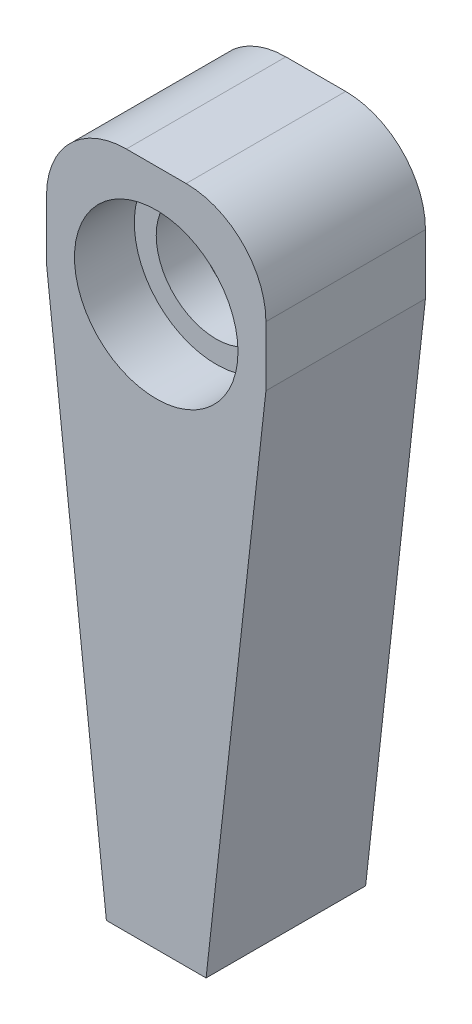
ISO-10303-21;
HEADER;
FILE_DESCRIPTION(('STEP AP214'),'2;1');
FILE_NAME('part.step','',(''),(''),'','','');
FILE_SCHEMA(('AUTOMOTIVE_DESIGN { 1 0 10303 214 1 1 1 1 }'));
ENDSEC;
DATA;
#1=APPLICATION_CONTEXT('core data for automotive mechanical design processes');
#2=APPLICATION_PROTOCOL_DEFINITION('international standard','automotive_design',2000,#1);
#3=PRODUCT_CONTEXT('',#1,'mechanical');
#4=PRODUCT('Part','Part','',(#3));
#5=PRODUCT_RELATED_PRODUCT_CATEGORY('part','',(#4));
#6=PRODUCT_DEFINITION_FORMATION('','',#4);
#7=PRODUCT_DEFINITION_CONTEXT('part definition',#1,'design');
#8=PRODUCT_DEFINITION('design','',#6,#7);
#9=PRODUCT_DEFINITION_SHAPE('','',#8);
#10=(LENGTH_UNIT() NAMED_UNIT(*) SI_UNIT(.MILLI.,.METRE.));
#11=(NAMED_UNIT(*) PLANE_ANGLE_UNIT() SI_UNIT($,.RADIAN.));
#12=(NAMED_UNIT(*) SI_UNIT($,.STERADIAN.) SOLID_ANGLE_UNIT());
#13=UNCERTAINTY_MEASURE_WITH_UNIT(LENGTH_MEASURE(1.E-05),#10,'distance_accuracy_value','');
#14=(GEOMETRIC_REPRESENTATION_CONTEXT(3) GLOBAL_UNCERTAINTY_ASSIGNED_CONTEXT((#13)) GLOBAL_UNIT_ASSIGNED_CONTEXT((#10,
#11,#12)) REPRESENTATION_CONTEXT('',''));
#15=CARTESIAN_POINT('',(0.,0.,0.));
#16=DIRECTION('',(0.,0.,1.));
#17=DIRECTION('',(1.,0.,0.));
#18=AXIS2_PLACEMENT_3D('',#15,#16,#17);
#19=CARTESIAN_POINT('',(0.,28.,4.));
#20=DIRECTION('',(0.,0.,-1.));
#21=DIRECTION('',(-1.,0.,0.));
#22=AXIS2_PLACEMENT_3D('',#19,#20,#21);
#23=CYLINDRICAL_SURFACE('',#22,3.);
#24=CARTESIAN_POINT('',(0.,28.,-0.999999999999999));
#25=DIRECTION('',(0.,0.,-1.));
#26=DIRECTION('',(-1.,0.,0.));
#27=AXIS2_PLACEMENT_3D('',#24,#25,#26);
#28=CIRCLE('',#27,3.);
#29=CARTESIAN_POINT('',(-3.,28.,-0.999999999999999));
#30=VERTEX_POINT('',#29);
#31=EDGE_CURVE('E179',#30,#30,#28,.T.);
#32=ORIENTED_EDGE('',*,*,#31,.T.);
#33=EDGE_LOOP('',(#32));
#34=FACE_BOUND('',#33,.T.);
#35=CARTESIAN_POINT('',(0.,28.,1.));
#36=DIRECTION('',(0.,0.,1.));
#37=DIRECTION('',(1.,0.,0.));
#38=AXIS2_PLACEMENT_3D('',#35,#36,#37);
#39=CIRCLE('',#38,3.);
#40=CARTESIAN_POINT('',(3.,28.,1.));
#41=VERTEX_POINT('',#40);
#42=EDGE_CURVE('E40',#41,#41,#39,.F.);
#43=ORIENTED_EDGE('',*,*,#42,.F.);
#44=EDGE_LOOP('',(#43));
#45=FACE_BOUND('',#44,.T.);
#46=ADVANCED_FACE('F36',(#34,#45),#23,.F.);
#47=CARTESIAN_POINT('',(-5.5,34.,4.));
#48=DIRECTION('',(1.,0.,0.));
#49=DIRECTION('',(0.,0.,-1.));
#50=AXIS2_PLACEMENT_3D('',#47,#48,#49);
#51=PLANE('',#50);
#52=DIRECTION('',(0.,-1.,0.));
#53=VECTOR('',#52,1.);
#54=CARTESIAN_POINT('',(-5.5,34.,4.));
#55=LINE('',#54,#53);
#56=CARTESIAN_POINT('',(-5.5,30.,4.));
#57=VERTEX_POINT('',#56);
#58=CARTESIAN_POINT('',(-5.5,27.,4.));
#59=VERTEX_POINT('',#58);
#60=EDGE_CURVE('E115',#57,#59,#55,.T.);
#61=ORIENTED_EDGE('',*,*,#60,.F.);
#62=DIRECTION('',(0.,0.,1.));
#63=VECTOR('',#62,1.);
#64=CARTESIAN_POINT('',(-5.5,30.,-4.));
#65=LINE('',#64,#63);
#66=CARTESIAN_POINT('',(-5.5,30.,-4.));
#67=VERTEX_POINT('',#66);
#68=EDGE_CURVE('E12',#57,#67,#65,.F.);
#69=ORIENTED_EDGE('',*,*,#68,.T.);
#70=DIRECTION('',(0.,-1.,0.));
#71=VECTOR('',#70,1.);
#72=CARTESIAN_POINT('',(-5.5,34.,-4.));
#73=LINE('',#72,#71);
#74=CARTESIAN_POINT('',(-5.5,27.,-4.));
#75=VERTEX_POINT('',#74);
#76=EDGE_CURVE('E139',#67,#75,#73,.T.);
#77=ORIENTED_EDGE('',*,*,#76,.T.);
#78=DIRECTION('',(0.,0.,-1.));
#79=VECTOR('',#78,1.);
#80=CARTESIAN_POINT('',(-5.5,27.,6.));
#81=LINE('',#80,#79);
#82=EDGE_CURVE('E169',#59,#75,#81,.T.);
#83=ORIENTED_EDGE('',*,*,#82,.F.);
#84=EDGE_LOOP('',(#61,#69,#77,#83));
#85=FACE_BOUND('',#84,.T.);
#86=ADVANCED_FACE('F191',(#85),#51,.F.);
#87=CARTESIAN_POINT('',(5.5,34.,4.));
#88=DIRECTION('',(0.,0.,-1.));
#89=DIRECTION('',(-1.,0.,0.));
#90=AXIS2_PLACEMENT_3D('',#87,#88,#89);
#91=PLANE('',#90);
#92=CARTESIAN_POINT('',(0.,28.,4.));
#93=DIRECTION('',(0.,0.,1.));
#94=DIRECTION('',(1.,0.,0.));
#95=AXIS2_PLACEMENT_3D('',#92,#93,#94);
#96=CIRCLE('',#95,4.1);
#97=CARTESIAN_POINT('',(4.1,28.,4.));
#98=VERTEX_POINT('',#97);
#99=EDGE_CURVE('E237',#98,#98,#96,.T.);
#100=ORIENTED_EDGE('',*,*,#99,.F.);
#101=EDGE_LOOP('',(#100));
#102=FACE_BOUND('',#101,.T.);
#103=DIRECTION('',(0.,-1.,0.));
#104=VECTOR('',#103,1.);
#105=CARTESIAN_POINT('',(5.5,34.,4.));
#106=LINE('',#105,#104);
#107=CARTESIAN_POINT('',(5.5,30.,4.));
#108=VERTEX_POINT('',#107);
#109=CARTESIAN_POINT('',(5.5,27.,4.));
#110=VERTEX_POINT('',#109);
#111=EDGE_CURVE('E142',#108,#110,#106,.T.);
#112=ORIENTED_EDGE('',*,*,#111,.F.);
#113=CARTESIAN_POINT('',(1.5,30.,4.));
#114=DIRECTION('',(0.,0.,-1.));
#115=DIRECTION('',(-1.,0.,0.));
#116=AXIS2_PLACEMENT_3D('',#113,#114,#115);
#117=CIRCLE('',#116,4.);
#118=CARTESIAN_POINT('',(1.5,34.,4.));
#119=VERTEX_POINT('',#118);
#120=EDGE_CURVE('E45',#108,#119,#117,.F.);
#121=ORIENTED_EDGE('',*,*,#120,.T.);
#122=DIRECTION('',(1.,0.,0.));
#123=VECTOR('',#122,1.);
#124=CARTESIAN_POINT('',(5.5,34.,4.));
#125=LINE('',#124,#123);
#126=CARTESIAN_POINT('',(-1.5,34.,4.));
#127=VERTEX_POINT('',#126);
#128=EDGE_CURVE('E129',#127,#119,#125,.T.);
#129=ORIENTED_EDGE('',*,*,#128,.F.);
#130=CARTESIAN_POINT('',(-1.5,30.,4.));
#131=DIRECTION('',(0.,0.,-1.));
#132=DIRECTION('',(-1.,0.,0.));
#133=AXIS2_PLACEMENT_3D('',#130,#131,#132);
#134=CIRCLE('',#133,4.);
#135=EDGE_CURVE('E52',#127,#57,#134,.F.);
#136=ORIENTED_EDGE('',*,*,#135,.T.);
#137=ORIENTED_EDGE('',*,*,#60,.T.);
#138=DIRECTION('',(-0.110431526074847,0.993883734673619,0.));
#139=VECTOR('',#138,1.);
#140=CARTESIAN_POINT('',(-6.13414634146341,32.7073170731707,4.));
#141=LINE('',#140,#139);
#142=CARTESIAN_POINT('',(-2.5,0.,4.));
#143=VERTEX_POINT('',#142);
#144=EDGE_CURVE('E176',#143,#59,#141,.T.);
#145=ORIENTED_EDGE('',*,*,#144,.F.);
#146=DIRECTION('',(1.,0.,0.));
#147=VECTOR('',#146,1.);
#148=CARTESIAN_POINT('',(5.5,0.,4.));
#149=LINE('',#148,#147);
#150=CARTESIAN_POINT('',(2.5,0.,4.));
#151=VERTEX_POINT('',#150);
#152=EDGE_CURVE('E130',#143,#151,#149,.T.);
#153=ORIENTED_EDGE('',*,*,#152,.T.);
#154=DIRECTION('',(-0.110431526074846,-0.993883734673619,0.));
#155=VECTOR('',#154,1.);
#156=CARTESIAN_POINT('',(6.26829268292683,33.9146341463415,4.));
#157=LINE('',#156,#155);
#158=EDGE_CURVE('E109',#110,#151,#157,.T.);
#159=ORIENTED_EDGE('',*,*,#158,.F.);
#160=EDGE_LOOP('',(#112,#121,#129,#136,#137,#145,#153,#159));
#161=FACE_BOUND('',#160,.T.);
#162=ADVANCED_FACE('F159',(#102,#161),#91,.F.);
#163=CARTESIAN_POINT('',(5.5,34.,4.));
#164=DIRECTION('',(-1.,0.,0.));
#165=DIRECTION('',(0.,0.,1.));
#166=AXIS2_PLACEMENT_3D('',#163,#164,#165);
#167=PLANE('',#166);
#168=DIRECTION('',(0.,-1.,0.));
#169=VECTOR('',#168,1.);
#170=CARTESIAN_POINT('',(5.5,34.,-4.));
#171=LINE('',#170,#169);
#172=CARTESIAN_POINT('',(5.5,30.,-4.));
#173=VERTEX_POINT('',#172);
#174=CARTESIAN_POINT('',(5.5,27.,-4.));
#175=VERTEX_POINT('',#174);
#176=EDGE_CURVE('E123',#173,#175,#171,.T.);
#177=ORIENTED_EDGE('',*,*,#176,.F.);
#178=DIRECTION('',(0.,0.,-1.));
#179=VECTOR('',#178,1.);
#180=CARTESIAN_POINT('',(5.5,30.,4.));
#181=LINE('',#180,#179);
#182=EDGE_CURVE('E60',#173,#108,#181,.F.);
#183=ORIENTED_EDGE('',*,*,#182,.T.);
#184=ORIENTED_EDGE('',*,*,#111,.T.);
#185=DIRECTION('',(0.,0.,-1.));
#186=VECTOR('',#185,1.);
#187=CARTESIAN_POINT('',(5.5,27.,6.));
#188=LINE('',#187,#186);
#189=EDGE_CURVE('E168',#110,#175,#188,.T.);
#190=ORIENTED_EDGE('',*,*,#189,.T.);
#191=EDGE_LOOP('',(#177,#183,#184,#190));
#192=FACE_BOUND('',#191,.T.);
#193=ADVANCED_FACE('F167',(#192),#167,.F.);
#194=CARTESIAN_POINT('',(5.5,34.,-4.));
#195=DIRECTION('',(0.,0.,1.));
#196=DIRECTION('',(1.,0.,0.));
#197=AXIS2_PLACEMENT_3D('',#194,#195,#196);
#198=PLANE('',#197);
#199=CARTESIAN_POINT('',(0.,28.,-4.));
#200=DIRECTION('',(0.,0.,-1.));
#201=DIRECTION('',(-1.,0.,0.));
#202=AXIS2_PLACEMENT_3D('',#199,#200,#201);
#203=CIRCLE('',#202,4.1);
#204=CARTESIAN_POINT('',(-4.1,28.,-4.));
#205=VERTEX_POINT('',#204);
#206=EDGE_CURVE('E182',#205,#205,#203,.T.);
#207=ORIENTED_EDGE('',*,*,#206,.F.);
#208=EDGE_LOOP('',(#207));
#209=FACE_BOUND('',#208,.T.);
#210=DIRECTION('',(-1.,0.,0.));
#211=VECTOR('',#210,1.);
#212=CARTESIAN_POINT('',(5.5,34.,-4.));
#213=LINE('',#212,#211);
#214=CARTESIAN_POINT('',(1.5,34.,-4.));
#215=VERTEX_POINT('',#214);
#216=CARTESIAN_POINT('',(-1.5,34.,-4.));
#217=VERTEX_POINT('',#216);
#218=EDGE_CURVE('E133',#215,#217,#213,.T.);
#219=ORIENTED_EDGE('',*,*,#218,.F.);
#220=CARTESIAN_POINT('',(1.5,30.,-4.));
#221=DIRECTION('',(0.,0.,1.));
#222=DIRECTION('',(1.,0.,0.));
#223=AXIS2_PLACEMENT_3D('',#220,#221,#222);
#224=CIRCLE('',#223,4.);
#225=EDGE_CURVE('E154',#215,#173,#224,.F.);
#226=ORIENTED_EDGE('',*,*,#225,.T.);
#227=ORIENTED_EDGE('',*,*,#176,.T.);
#228=DIRECTION('',(-0.110431526074846,-0.993883734673619,0.));
#229=VECTOR('',#228,1.);
#230=CARTESIAN_POINT('',(5.5,27.,-4.));
#231=LINE('',#230,#229);
#232=CARTESIAN_POINT('',(2.5,0.,-4.));
#233=VERTEX_POINT('',#232);
#234=EDGE_CURVE('E106',#175,#233,#231,.T.);
#235=ORIENTED_EDGE('',*,*,#234,.T.);
#236=DIRECTION('',(-1.,0.,0.));
#237=VECTOR('',#236,1.);
#238=CARTESIAN_POINT('',(5.5,0.,-4.));
#239=LINE('',#238,#237);
#240=CARTESIAN_POINT('',(-2.5,0.,-4.));
#241=VERTEX_POINT('',#240);
#242=EDGE_CURVE('E122',#233,#241,#239,.T.);
#243=ORIENTED_EDGE('',*,*,#242,.T.);
#244=DIRECTION('',(-0.110431526074847,0.993883734673619,0.));
#245=VECTOR('',#244,1.);
#246=CARTESIAN_POINT('',(-2.5,0.,-4.));
#247=LINE('',#246,#245);
#248=EDGE_CURVE('E124',#241,#75,#247,.T.);
#249=ORIENTED_EDGE('',*,*,#248,.T.);
#250=ORIENTED_EDGE('',*,*,#76,.F.);
#251=CARTESIAN_POINT('',(-1.5,30.,-4.));
#252=DIRECTION('',(0.,0.,1.));
#253=DIRECTION('',(1.,0.,0.));
#254=AXIS2_PLACEMENT_3D('',#251,#252,#253);
#255=CIRCLE('',#254,4.);
#256=EDGE_CURVE('E152',#67,#217,#255,.F.);
#257=ORIENTED_EDGE('',*,*,#256,.T.);
#258=EDGE_LOOP('',(#219,#226,#227,#235,#243,#249,#250,#257));
#259=FACE_BOUND('',#258,.T.);
#260=ADVANCED_FACE('F120',(#209,#259),#198,.F.);
#261=CARTESIAN_POINT('',(0.,0.,0.));
#262=DIRECTION('',(0.,1.,0.));
#263=DIRECTION('',(0.,0.,1.));
#264=AXIS2_PLACEMENT_3D('',#261,#262,#263);
#265=PLANE('',#264);
#266=CARTESIAN_POINT('',(0.,0.,0.));
#267=DIRECTION('',(0.,-1.,0.));
#268=DIRECTION('',(0.,0.,-1.));
#269=AXIS2_PLACEMENT_3D('',#266,#267,#268);
#270=CIRCLE('',#269,0.65);
#271=CARTESIAN_POINT('',(0.,0.,-0.65));
#272=VERTEX_POINT('',#271);
#273=EDGE_CURVE('E246',#272,#272,#270,.T.);
#274=ORIENTED_EDGE('',*,*,#273,.F.);
#275=EDGE_LOOP('',(#274));
#276=FACE_BOUND('',#275,.T.);
#277=DIRECTION('',(0.,0.,1.));
#278=VECTOR('',#277,1.);
#279=CARTESIAN_POINT('',(-2.5,0.,0.));
#280=LINE('',#279,#278);
#281=EDGE_CURVE('E114',#241,#143,#280,.T.);
#282=ORIENTED_EDGE('',*,*,#281,.F.);
#283=ORIENTED_EDGE('',*,*,#242,.F.);
#284=DIRECTION('',(0.,0.,-1.));
#285=VECTOR('',#284,1.);
#286=CARTESIAN_POINT('',(2.5,0.,0.));
#287=LINE('',#286,#285);
#288=EDGE_CURVE('E102',#151,#233,#287,.T.);
#289=ORIENTED_EDGE('',*,*,#288,.F.);
#290=ORIENTED_EDGE('',*,*,#152,.F.);
#291=EDGE_LOOP('',(#282,#283,#289,#290));
#292=FACE_BOUND('',#291,.T.);
#293=ADVANCED_FACE('F128',(#276,#292),#265,.F.);
#294=CARTESIAN_POINT('',(0.,34.,0.));
#295=DIRECTION('',(0.,1.,0.));
#296=DIRECTION('',(0.,0.,1.));
#297=AXIS2_PLACEMENT_3D('',#294,#295,#296);
#298=PLANE('',#297);
#299=ORIENTED_EDGE('',*,*,#128,.T.);
#300=DIRECTION('',(0.,0.,-1.));
#301=VECTOR('',#300,1.);
#302=CARTESIAN_POINT('',(1.5,34.,-4.));
#303=LINE('',#302,#301);
#304=EDGE_CURVE('E149',#119,#215,#303,.T.);
#305=ORIENTED_EDGE('',*,*,#304,.T.);
#306=ORIENTED_EDGE('',*,*,#218,.T.);
#307=DIRECTION('',(0.,0.,1.));
#308=VECTOR('',#307,1.);
#309=CARTESIAN_POINT('',(-1.5,34.,4.));
#310=LINE('',#309,#308);
#311=EDGE_CURVE('E146',#217,#127,#310,.T.);
#312=ORIENTED_EDGE('',*,*,#311,.T.);
#313=EDGE_LOOP('',(#299,#305,#306,#312));
#314=FACE_BOUND('',#313,.T.);
#315=ADVANCED_FACE('F163',(#314),#298,.T.);
#316=CARTESIAN_POINT('',(0.,28.,-0.999999999999999));
#317=DIRECTION('',(0.,0.,-1.));
#318=DIRECTION('',(-1.,0.,0.));
#319=AXIS2_PLACEMENT_3D('',#316,#317,#318);
#320=CYLINDRICAL_SURFACE('',#319,4.1);
#321=CARTESIAN_POINT('',(0.,28.,-0.999999999999999));
#322=DIRECTION('',(0.,0.,-1.));
#323=DIRECTION('',(-1.,0.,0.));
#324=AXIS2_PLACEMENT_3D('',#321,#322,#323);
#325=CIRCLE('',#324,4.1);
#326=CARTESIAN_POINT('',(-4.1,28.,-0.999999999999999));
#327=VERTEX_POINT('',#326);
#328=EDGE_CURVE('E135',#327,#327,#325,.T.);
#329=ORIENTED_EDGE('',*,*,#328,.F.);
#330=EDGE_LOOP('',(#329));
#331=FACE_BOUND('',#330,.T.);
#332=ORIENTED_EDGE('',*,*,#206,.T.);
#333=EDGE_LOOP('',(#332));
#334=FACE_BOUND('',#333,.T.);
#335=ADVANCED_FACE('F216',(#331,#334),#320,.F.);
#336=CARTESIAN_POINT('',(0.,28.,-0.999999999999999));
#337=DIRECTION('',(0.,0.,-1.));
#338=DIRECTION('',(-1.,0.,0.));
#339=AXIS2_PLACEMENT_3D('',#336,#337,#338);
#340=PLANE('',#339);
#341=ORIENTED_EDGE('',*,*,#31,.F.);
#342=EDGE_LOOP('',(#341));
#343=FACE_BOUND('',#342,.T.);
#344=ORIENTED_EDGE('',*,*,#328,.T.);
#345=EDGE_LOOP('',(#344));
#346=FACE_BOUND('',#345,.T.);
#347=ADVANCED_FACE('F202',(#343,#346),#340,.T.);
#348=CARTESIAN_POINT('',(5.5,27.,6.));
#349=DIRECTION('',(0.993883734673619,-0.110431526074846,0.));
#350=DIRECTION('',(0.110431526074846,0.993883734673619,0.));
#351=AXIS2_PLACEMENT_3D('',#348,#349,#350);
#352=PLANE('',#351);
#353=ORIENTED_EDGE('',*,*,#158,.T.);
#354=ORIENTED_EDGE('',*,*,#288,.T.);
#355=ORIENTED_EDGE('',*,*,#234,.F.);
#356=ORIENTED_EDGE('',*,*,#189,.F.);
#357=EDGE_LOOP('',(#353,#354,#355,#356));
#358=FACE_BOUND('',#357,.T.);
#359=ADVANCED_FACE('F104',(#358),#352,.T.);
#360=CARTESIAN_POINT('',(-2.5,0.,6.));
#361=DIRECTION('',(-0.993883734673619,-0.110431526074847,0.));
#362=DIRECTION('',(0.110431526074847,-0.993883734673619,0.));
#363=AXIS2_PLACEMENT_3D('',#360,#361,#362);
#364=PLANE('',#363);
#365=ORIENTED_EDGE('',*,*,#144,.T.);
#366=ORIENTED_EDGE('',*,*,#82,.T.);
#367=ORIENTED_EDGE('',*,*,#248,.F.);
#368=ORIENTED_EDGE('',*,*,#281,.T.);
#369=EDGE_LOOP('',(#365,#366,#367,#368));
#370=FACE_BOUND('',#369,.T.);
#371=ADVANCED_FACE('F194',(#370),#364,.T.);
#372=CARTESIAN_POINT('',(1.5,30.,0.));
#373=DIRECTION('',(0.,0.,1.));
#374=DIRECTION('',(1.,0.,0.));
#375=AXIS2_PLACEMENT_3D('',#372,#373,#374);
#376=CYLINDRICAL_SURFACE('',#375,4.);
#377=ORIENTED_EDGE('',*,*,#120,.F.);
#378=ORIENTED_EDGE('',*,*,#182,.F.);
#379=ORIENTED_EDGE('',*,*,#225,.F.);
#380=ORIENTED_EDGE('',*,*,#304,.F.);
#381=EDGE_LOOP('',(#377,#378,#379,#380));
#382=FACE_BOUND('',#381,.T.);
#383=ADVANCED_FACE('F166',(#382),#376,.T.);
#384=CARTESIAN_POINT('',(-1.5,30.,0.));
#385=DIRECTION('',(0.,0.,-1.));
#386=DIRECTION('',(-1.,0.,0.));
#387=AXIS2_PLACEMENT_3D('',#384,#385,#386);
#388=CYLINDRICAL_SURFACE('',#387,4.);
#389=ORIENTED_EDGE('',*,*,#256,.F.);
#390=ORIENTED_EDGE('',*,*,#68,.F.);
#391=ORIENTED_EDGE('',*,*,#135,.F.);
#392=ORIENTED_EDGE('',*,*,#311,.F.);
#393=EDGE_LOOP('',(#389,#390,#391,#392));
#394=FACE_BOUND('',#393,.T.);
#395=ADVANCED_FACE('F38',(#394),#388,.T.);
#396=CARTESIAN_POINT('',(0.,20.,0.));
#397=DIRECTION('',(0.,-1.,0.));
#398=DIRECTION('',(0.,0.,-1.));
#399=AXIS2_PLACEMENT_3D('',#396,#397,#398);
#400=CYLINDRICAL_SURFACE('',#399,0.65);
#401=CARTESIAN_POINT('',(0.,20.,0.));
#402=DIRECTION('',(0.,-1.,0.));
#403=DIRECTION('',(0.,0.,-1.));
#404=AXIS2_PLACEMENT_3D('',#401,#402,#403);
#405=CIRCLE('',#404,0.65);
#406=CARTESIAN_POINT('',(0.,20.,-0.65));
#407=VERTEX_POINT('',#406);
#408=EDGE_CURVE('E125',#407,#407,#405,.T.);
#409=ORIENTED_EDGE('',*,*,#408,.F.);
#410=EDGE_LOOP('',(#409));
#411=FACE_BOUND('',#410,.T.);
#412=ORIENTED_EDGE('',*,*,#273,.T.);
#413=EDGE_LOOP('',(#412));
#414=FACE_BOUND('',#413,.T.);
#415=ADVANCED_FACE('F265',(#411,#414),#400,.F.);
#416=CARTESIAN_POINT('',(0.,20.,0.));
#417=DIRECTION('',(0.,-1.,0.));
#418=DIRECTION('',(0.,0.,-1.));
#419=AXIS2_PLACEMENT_3D('',#416,#417,#418);
#420=PLANE('',#419);
#421=ORIENTED_EDGE('',*,*,#408,.T.);
#422=EDGE_LOOP('',(#421));
#423=FACE_BOUND('',#422,.T.);
#424=ADVANCED_FACE('F256',(#423),#420,.T.);
#425=CARTESIAN_POINT('',(0.,28.,1.));
#426=DIRECTION('',(0.,0.,1.));
#427=DIRECTION('',(1.,0.,0.));
#428=AXIS2_PLACEMENT_3D('',#425,#426,#427);
#429=PLANE('',#428);
#430=CARTESIAN_POINT('',(0.,28.,1.));
#431=DIRECTION('',(0.,0.,1.));
#432=DIRECTION('',(1.,0.,0.));
#433=AXIS2_PLACEMENT_3D('',#430,#431,#432);
#434=CIRCLE('',#433,4.1);
#435=CARTESIAN_POINT('',(4.1,28.,1.));
#436=VERTEX_POINT('',#435);
#437=EDGE_CURVE('E239',#436,#436,#434,.T.);
#438=ORIENTED_EDGE('',*,*,#437,.T.);
#439=EDGE_LOOP('',(#438));
#440=FACE_BOUND('',#439,.T.);
#441=ORIENTED_EDGE('',*,*,#42,.T.);
#442=EDGE_LOOP('',(#441));
#443=FACE_BOUND('',#442,.T.);
#444=ADVANCED_FACE('F253',(#440,#443),#429,.T.);
#445=CARTESIAN_POINT('',(0.,28.,1.));
#446=DIRECTION('',(0.,0.,1.));
#447=DIRECTION('',(1.,0.,0.));
#448=AXIS2_PLACEMENT_3D('',#445,#446,#447);
#449=CYLINDRICAL_SURFACE('',#448,4.1);
#450=ORIENTED_EDGE('',*,*,#437,.F.);
#451=EDGE_LOOP('',(#450));
#452=FACE_BOUND('',#451,.T.);
#453=ORIENTED_EDGE('',*,*,#99,.T.);
#454=EDGE_LOOP('',(#453));
#455=FACE_BOUND('',#454,.T.);
#456=ADVANCED_FACE('F255',(#452,#455),#449,.F.);
#457=CLOSED_SHELL('',(#46,#86,#162,#193,#260,#293,#315,#335,#347,#359,#371,#383,#395,#415,#424,
#444,#456));
#458=MANIFOLD_SOLID_BREP('B2',#457);
#459=ADVANCED_BREP_SHAPE_REPRESENTATION('',(#18,#458),#14);
#460=SHAPE_DEFINITION_REPRESENTATION(#9,#459);
ENDSEC;
END-ISO-10303-21;
